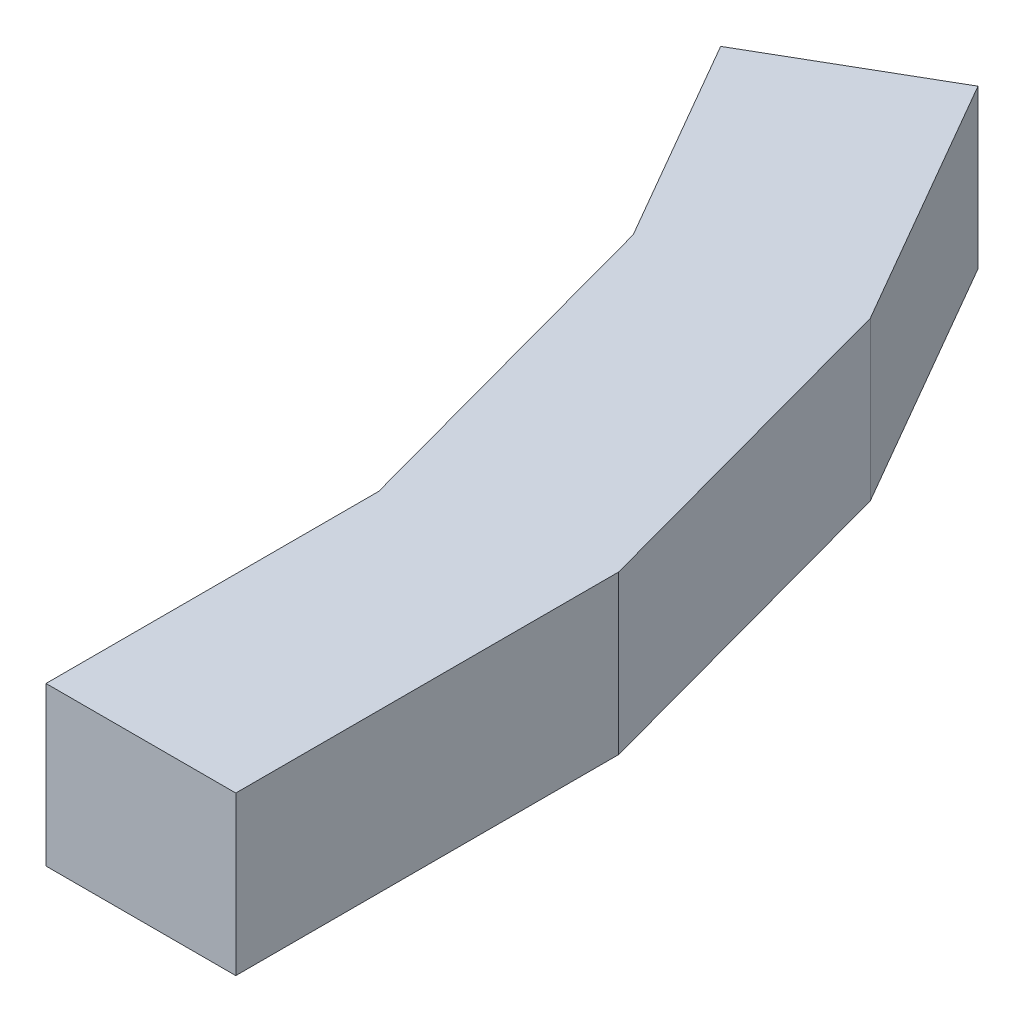
ISO-10303-21;
HEADER;
FILE_DESCRIPTION(('STEP AP214'),'2;1');
FILE_NAME('part.step','',(''),(''),'','','');
FILE_SCHEMA(('AUTOMOTIVE_DESIGN { 1 0 10303 214 1 1 1 1 }'));
ENDSEC;
DATA;
#1=APPLICATION_CONTEXT('core data for automotive mechanical design processes');
#2=APPLICATION_PROTOCOL_DEFINITION('international standard','automotive_design',2000,#1);
#3=PRODUCT_CONTEXT('',#1,'mechanical');
#4=PRODUCT('Part','Part','',(#3));
#5=PRODUCT_RELATED_PRODUCT_CATEGORY('part','',(#4));
#6=PRODUCT_DEFINITION_FORMATION('','',#4);
#7=PRODUCT_DEFINITION_CONTEXT('part definition',#1,'design');
#8=PRODUCT_DEFINITION('design','',#6,#7);
#9=PRODUCT_DEFINITION_SHAPE('','',#8);
#10=(LENGTH_UNIT() NAMED_UNIT(*) SI_UNIT(.MILLI.,.METRE.));
#11=(NAMED_UNIT(*) PLANE_ANGLE_UNIT() SI_UNIT($,.RADIAN.));
#12=(NAMED_UNIT(*) SI_UNIT($,.STERADIAN.) SOLID_ANGLE_UNIT());
#13=UNCERTAINTY_MEASURE_WITH_UNIT(LENGTH_MEASURE(1.E-05),#10,'distance_accuracy_value','');
#14=(GEOMETRIC_REPRESENTATION_CONTEXT(3) GLOBAL_UNCERTAINTY_ASSIGNED_CONTEXT((#13)) GLOBAL_UNIT_ASSIGNED_CONTEXT((#10,
#11,#12)) REPRESENTATION_CONTEXT('',''));
#15=CARTESIAN_POINT('',(0.,0.,0.));
#16=DIRECTION('',(0.,0.,1.));
#17=DIRECTION('',(1.,0.,0.));
#18=AXIS2_PLACEMENT_3D('',#15,#16,#17);
#19=CARTESIAN_POINT('',(790.774788972414,500.,-456.554037281603));
#20=DIRECTION('',(0.866025403784434,0.,-0.500000000000009));
#21=DIRECTION('',(-0.500000000000009,0.,-0.866025403784434));
#22=AXIS2_PLACEMENT_3D('',#19,#20,#21);
#23=PLANE('',#22);
#24=DIRECTION('',(0.500000000000009,0.,0.866025403784434));
#25=VECTOR('',#24,1.);
#26=CARTESIAN_POINT('',(790.774788972414,0.,-456.554037281603));
#27=LINE('',#26,#25);
#28=CARTESIAN_POINT('',(36.8110568460779,0.,-1762.45752838864));
#29=VERTEX_POINT('',#28);
#30=CARTESIAN_POINT('',(502.083882716591,0.,-956.581354599782));
#31=VERTEX_POINT('',#30);
#32=EDGE_CURVE('E117',#29,#31,#27,.T.);
#33=ORIENTED_EDGE('',*,*,#32,.F.);
#34=DIRECTION('',(0.,-1.,0.));
#35=VECTOR('',#34,1.);
#36=CARTESIAN_POINT('',(36.8110568460779,500.,-1762.45752838864));
#37=LINE('',#36,#35);
#38=CARTESIAN_POINT('',(36.8110568460779,500.,-1762.45752838864));
#39=VERTEX_POINT('',#38);
#40=EDGE_CURVE('E11',#39,#29,#37,.T.);
#41=ORIENTED_EDGE('',*,*,#40,.F.);
#42=DIRECTION('',(0.500000000000009,0.,0.866025403784434));
#43=VECTOR('',#42,1.);
#44=CARTESIAN_POINT('',(790.774788972414,500.,-456.554037281603));
#45=LINE('',#44,#43);
#46=CARTESIAN_POINT('',(502.083882716591,500.,-956.581354599782));
#47=VERTEX_POINT('',#46);
#48=EDGE_CURVE('E48',#39,#47,#45,.T.);
#49=ORIENTED_EDGE('',*,*,#48,.T.);
#50=DIRECTION('',(0.,-1.,0.));
#51=VECTOR('',#50,1.);
#52=CARTESIAN_POINT('',(502.083882716591,500.,-956.581354599782));
#53=LINE('',#52,#51);
#54=EDGE_CURVE('E67',#47,#31,#53,.T.);
#55=ORIENTED_EDGE('',*,*,#54,.T.);
#56=EDGE_LOOP('',(#33,#41,#49,#55));
#57=FACE_BOUND('',#56,.T.);
#58=ADVANCED_FACE('F32',(#57),#23,.T.);
#59=CARTESIAN_POINT('',(-753.963732126336,500.,-1305.90349110704));
#60=DIRECTION('',(-0.500000000000008,0.,-0.866025403784434));
#61=DIRECTION('',(-0.866025403784434,0.,0.500000000000008));
#62=AXIS2_PLACEMENT_3D('',#59,#60,#61);
#63=PLANE('',#62);
#64=DIRECTION('',(0.866025403784434,0.,-0.500000000000008));
#65=VECTOR('',#64,1.);
#66=CARTESIAN_POINT('',(-753.963732126336,0.,-1305.90349110704));
#67=LINE('',#66,#65);
#68=CARTESIAN_POINT('',(-479.010759858195,0.,-1464.64766366054));
#69=VERTEX_POINT('',#68);
#70=EDGE_CURVE('E154',#69,#29,#67,.T.);
#71=ORIENTED_EDGE('',*,*,#70,.F.);
#72=DIRECTION('',(0.,-1.,0.));
#73=VECTOR('',#72,1.);
#74=CARTESIAN_POINT('',(-479.010759858195,500.,-1464.64766366054));
#75=LINE('',#74,#73);
#76=CARTESIAN_POINT('',(-479.010759858195,500.,-1464.64766366054));
#77=VERTEX_POINT('',#76);
#78=EDGE_CURVE('E40',#77,#69,#75,.T.);
#79=ORIENTED_EDGE('',*,*,#78,.F.);
#80=DIRECTION('',(0.866025403784434,0.,-0.500000000000008));
#81=VECTOR('',#80,1.);
#82=CARTESIAN_POINT('',(-753.963732126336,500.,-1305.90349110704));
#83=LINE('',#82,#81);
#84=EDGE_CURVE('E148',#77,#39,#83,.T.);
#85=ORIENTED_EDGE('',*,*,#84,.T.);
#86=ORIENTED_EDGE('',*,*,#40,.T.);
#87=EDGE_LOOP('',(#71,#79,#85,#86));
#88=FACE_BOUND('',#87,.T.);
#89=ADVANCED_FACE('F177',(#88),#63,.T.);
#90=CARTESIAN_POINT('',(274.952972268142,500.,-158.744172553503));
#91=DIRECTION('',(-0.866025403784434,0.,0.500000000000008));
#92=DIRECTION('',(0.500000000000008,0.,0.866025403784434));
#93=AXIS2_PLACEMENT_3D('',#90,#91,#92);
#94=PLANE('',#93);
#95=DIRECTION('',(-0.500000000000008,0.,-0.866025403784434));
#96=VECTOR('',#95,1.);
#97=CARTESIAN_POINT('',(274.952972268142,0.,-158.744172553503));
#98=LINE('',#97,#96);
#99=CARTESIAN_POINT('',(-101.477144029625,0.,-810.740259480282));
#100=VERTEX_POINT('',#99);
#101=EDGE_CURVE('E149',#100,#69,#98,.T.);
#102=ORIENTED_EDGE('',*,*,#101,.F.);
#103=DIRECTION('',(0.,-1.,0.));
#104=VECTOR('',#103,1.);
#105=CARTESIAN_POINT('',(-101.477144029625,500.,-810.740259480282));
#106=LINE('',#105,#104);
#107=CARTESIAN_POINT('',(-101.477144029625,500.,-810.740259480282));
#108=VERTEX_POINT('',#107);
#109=EDGE_CURVE('E160',#108,#100,#106,.T.);
#110=ORIENTED_EDGE('',*,*,#109,.F.);
#111=DIRECTION('',(-0.500000000000008,0.,-0.866025403784434));
#112=VECTOR('',#111,1.);
#113=CARTESIAN_POINT('',(274.952972268142,500.,-158.744172553503));
#114=LINE('',#113,#112);
#115=EDGE_CURVE('E105',#108,#77,#114,.T.);
#116=ORIENTED_EDGE('',*,*,#115,.T.);
#117=ORIENTED_EDGE('',*,*,#78,.T.);
#118=EDGE_LOOP('',(#102,#110,#116,#117));
#119=FACE_BOUND('',#118,.T.);
#120=ADVANCED_FACE('F181',(#119),#94,.T.);
#121=CARTESIAN_POINT('',(0.,500.,0.));
#122=DIRECTION('',(0.,1.,0.));
#123=DIRECTION('',(0.,0.,1.));
#124=AXIS2_PLACEMENT_3D('',#121,#122,#123);
#125=PLANE('',#124);
#126=ORIENTED_EDGE('',*,*,#48,.F.);
#127=ORIENTED_EDGE('',*,*,#84,.F.);
#128=ORIENTED_EDGE('',*,*,#115,.F.);
#129=DIRECTION('',(0.262270475874692,0.,0.964994402825458));
#130=VECTOR('',#129,1.);
#131=CARTESIAN_POINT('',(110.692923100517,500.,-30.0846155506503));
#132=LINE('',#131,#130);
#133=CARTESIAN_POINT('',(198.897925490181,500.,294.455664186745));
#134=VERTEX_POINT('',#133);
#135=EDGE_CURVE('E98',#108,#134,#132,.T.);
#136=ORIENTED_EDGE('',*,*,#135,.T.);
#137=DIRECTION('',(0.,0.,1.));
#138=VECTOR('',#137,1.);
#139=CARTESIAN_POINT('',(198.897925490181,500.,0.));
#140=LINE('',#139,#138);
#141=CARTESIAN_POINT('',(198.897925490182,500.,1346.18983562743));
#142=VERTEX_POINT('',#141);
#143=EDGE_CURVE('E102',#134,#142,#140,.T.);
#144=ORIENTED_EDGE('',*,*,#143,.T.);
#145=DIRECTION('',(1.,0.,0.));
#146=VECTOR('',#145,1.);
#147=CARTESIAN_POINT('',(0.,500.,1346.18983562743));
#148=LINE('',#147,#146);
#149=CARTESIAN_POINT('',(798.897925490182,500.,1346.18983562743));
#150=VERTEX_POINT('',#149);
#151=EDGE_CURVE('E123',#142,#150,#148,.T.);
#152=ORIENTED_EDGE('',*,*,#151,.T.);
#153=DIRECTION('',(0.,0.,-1.));
#154=VECTOR('',#153,1.);
#155=CARTESIAN_POINT('',(798.897925490182,500.,0.));
#156=LINE('',#155,#154);
#157=CARTESIAN_POINT('',(798.897925490182,500.,135.512175948272));
#158=VERTEX_POINT('',#157);
#159=EDGE_CURVE('E125',#150,#158,#156,.T.);
#160=ORIENTED_EDGE('',*,*,#159,.T.);
#161=DIRECTION('',(-0.262270475874692,0.,-0.964994402825458));
#162=VECTOR('',#161,1.);
#163=CARTESIAN_POINT('',(709.648376113421,500.,-192.871395691021));
#164=LINE('',#163,#162);
#165=EDGE_CURVE('E108',#158,#47,#164,.T.);
#166=ORIENTED_EDGE('',*,*,#165,.T.);
#167=EDGE_LOOP('',(#126,#127,#128,#136,#144,#152,#160,#166));
#168=FACE_BOUND('',#167,.T.);
#169=ADVANCED_FACE('F100',(#168),#125,.T.);
#170=CARTESIAN_POINT('',(0.,0.,0.));
#171=DIRECTION('',(0.,1.,0.));
#172=DIRECTION('',(0.,0.,1.));
#173=AXIS2_PLACEMENT_3D('',#170,#171,#172);
#174=PLANE('',#173);
#175=ORIENTED_EDGE('',*,*,#32,.T.);
#176=DIRECTION('',(-0.262270475874692,0.,-0.964994402825458));
#177=VECTOR('',#176,1.);
#178=CARTESIAN_POINT('',(709.648376113421,0.,-192.871395691021));
#179=LINE('',#178,#177);
#180=CARTESIAN_POINT('',(798.897925490182,0.,135.512175948272));
#181=VERTEX_POINT('',#180);
#182=EDGE_CURVE('E131',#181,#31,#179,.T.);
#183=ORIENTED_EDGE('',*,*,#182,.F.);
#184=DIRECTION('',(0.,0.,-1.));
#185=VECTOR('',#184,1.);
#186=CARTESIAN_POINT('',(798.897925490182,0.,0.));
#187=LINE('',#186,#185);
#188=CARTESIAN_POINT('',(798.897925490182,0.,1346.18983562743));
#189=VERTEX_POINT('',#188);
#190=EDGE_CURVE('E139',#189,#181,#187,.T.);
#191=ORIENTED_EDGE('',*,*,#190,.F.);
#192=DIRECTION('',(1.,0.,0.));
#193=VECTOR('',#192,1.);
#194=CARTESIAN_POINT('',(0.,0.,1346.18983562743));
#195=LINE('',#194,#193);
#196=CARTESIAN_POINT('',(198.897925490182,0.,1346.18983562743));
#197=VERTEX_POINT('',#196);
#198=EDGE_CURVE('E137',#197,#189,#195,.T.);
#199=ORIENTED_EDGE('',*,*,#198,.F.);
#200=DIRECTION('',(0.,0.,1.));
#201=VECTOR('',#200,1.);
#202=CARTESIAN_POINT('',(198.897925490181,0.,0.));
#203=LINE('',#202,#201);
#204=CARTESIAN_POINT('',(198.897925490181,0.,294.455664186745));
#205=VERTEX_POINT('',#204);
#206=EDGE_CURVE('E135',#205,#197,#203,.T.);
#207=ORIENTED_EDGE('',*,*,#206,.F.);
#208=DIRECTION('',(0.262270475874692,0.,0.964994402825458));
#209=VECTOR('',#208,1.);
#210=CARTESIAN_POINT('',(110.692923100517,0.,-30.0846155506503));
#211=LINE('',#210,#209);
#212=EDGE_CURVE('E114',#100,#205,#211,.T.);
#213=ORIENTED_EDGE('',*,*,#212,.F.);
#214=ORIENTED_EDGE('',*,*,#101,.T.);
#215=ORIENTED_EDGE('',*,*,#70,.T.);
#216=EDGE_LOOP('',(#175,#183,#191,#199,#207,#213,#214,#215));
#217=FACE_BOUND('',#216,.T.);
#218=ADVANCED_FACE('F162',(#217),#174,.F.);
#219=CARTESIAN_POINT('',(709.648376113421,500.,-192.871395691021));
#220=DIRECTION('',(-0.964994402825458,0.,0.262270475874692));
#221=DIRECTION('',(0.262270475874692,0.,0.964994402825458));
#222=AXIS2_PLACEMENT_3D('',#219,#220,#221);
#223=PLANE('',#222);
#224=ORIENTED_EDGE('',*,*,#182,.T.);
#225=ORIENTED_EDGE('',*,*,#54,.F.);
#226=ORIENTED_EDGE('',*,*,#165,.F.);
#227=DIRECTION('',(0.,-1.,0.));
#228=VECTOR('',#227,1.);
#229=CARTESIAN_POINT('',(798.897925490182,500.,135.512175948272));
#230=LINE('',#229,#228);
#231=EDGE_CURVE('E130',#158,#181,#230,.T.);
#232=ORIENTED_EDGE('',*,*,#231,.T.);
#233=EDGE_LOOP('',(#224,#225,#226,#232));
#234=FACE_BOUND('',#233,.T.);
#235=ADVANCED_FACE('F175',(#234),#223,.F.);
#236=CARTESIAN_POINT('',(110.692923100517,500.,-30.0846155506503));
#237=DIRECTION('',(0.964994402825458,0.,-0.262270475874692));
#238=DIRECTION('',(-0.262270475874692,0.,-0.964994402825458));
#239=AXIS2_PLACEMENT_3D('',#236,#237,#238);
#240=PLANE('',#239);
#241=ORIENTED_EDGE('',*,*,#212,.T.);
#242=DIRECTION('',(0.,-1.,0.));
#243=VECTOR('',#242,1.);
#244=CARTESIAN_POINT('',(198.897925490181,500.,294.455664186745));
#245=LINE('',#244,#243);
#246=EDGE_CURVE('E111',#134,#205,#245,.T.);
#247=ORIENTED_EDGE('',*,*,#246,.F.);
#248=ORIENTED_EDGE('',*,*,#135,.F.);
#249=ORIENTED_EDGE('',*,*,#109,.T.);
#250=EDGE_LOOP('',(#241,#247,#248,#249));
#251=FACE_BOUND('',#250,.T.);
#252=ADVANCED_FACE('F112',(#251),#240,.F.);
#253=CARTESIAN_POINT('',(198.897925490181,500.,0.));
#254=DIRECTION('',(1.,0.,0.));
#255=DIRECTION('',(0.,0.,-1.));
#256=AXIS2_PLACEMENT_3D('',#253,#254,#255);
#257=PLANE('',#256);
#258=ORIENTED_EDGE('',*,*,#206,.T.);
#259=DIRECTION('',(0.,-1.,0.));
#260=VECTOR('',#259,1.);
#261=CARTESIAN_POINT('',(198.897925490182,500.,1346.18983562743));
#262=LINE('',#261,#260);
#263=EDGE_CURVE('E118',#142,#197,#262,.T.);
#264=ORIENTED_EDGE('',*,*,#263,.F.);
#265=ORIENTED_EDGE('',*,*,#143,.F.);
#266=ORIENTED_EDGE('',*,*,#246,.T.);
#267=EDGE_LOOP('',(#258,#264,#265,#266));
#268=FACE_BOUND('',#267,.T.);
#269=ADVANCED_FACE('F120',(#268),#257,.F.);
#270=CARTESIAN_POINT('',(0.,500.,1346.18983562743));
#271=DIRECTION('',(0.,0.,-1.));
#272=DIRECTION('',(-1.,0.,0.));
#273=AXIS2_PLACEMENT_3D('',#270,#271,#272);
#274=PLANE('',#273);
#275=ORIENTED_EDGE('',*,*,#198,.T.);
#276=DIRECTION('',(0.,-1.,0.));
#277=VECTOR('',#276,1.);
#278=CARTESIAN_POINT('',(798.897925490182,500.,1346.18983562743));
#279=LINE('',#278,#277);
#280=EDGE_CURVE('E143',#150,#189,#279,.T.);
#281=ORIENTED_EDGE('',*,*,#280,.F.);
#282=ORIENTED_EDGE('',*,*,#151,.F.);
#283=ORIENTED_EDGE('',*,*,#263,.T.);
#284=EDGE_LOOP('',(#275,#281,#282,#283));
#285=FACE_BOUND('',#284,.T.);
#286=ADVANCED_FACE('F166',(#285),#274,.F.);
#287=CARTESIAN_POINT('',(798.897925490182,500.,0.));
#288=DIRECTION('',(-1.,0.,0.));
#289=DIRECTION('',(0.,0.,1.));
#290=AXIS2_PLACEMENT_3D('',#287,#288,#289);
#291=PLANE('',#290);
#292=ORIENTED_EDGE('',*,*,#190,.T.);
#293=ORIENTED_EDGE('',*,*,#231,.F.);
#294=ORIENTED_EDGE('',*,*,#159,.F.);
#295=ORIENTED_EDGE('',*,*,#280,.T.);
#296=EDGE_LOOP('',(#292,#293,#294,#295));
#297=FACE_BOUND('',#296,.T.);
#298=ADVANCED_FACE('F172',(#297),#291,.F.);
#299=CLOSED_SHELL('',(#58,#89,#120,#169,#218,#235,#252,#269,#286,#298));
#300=MANIFOLD_SOLID_BREP('B2',#299);
#301=ADVANCED_BREP_SHAPE_REPRESENTATION('',(#18,#300),#14);
#302=SHAPE_DEFINITION_REPRESENTATION(#9,#301);
ENDSEC;
END-ISO-10303-21;
